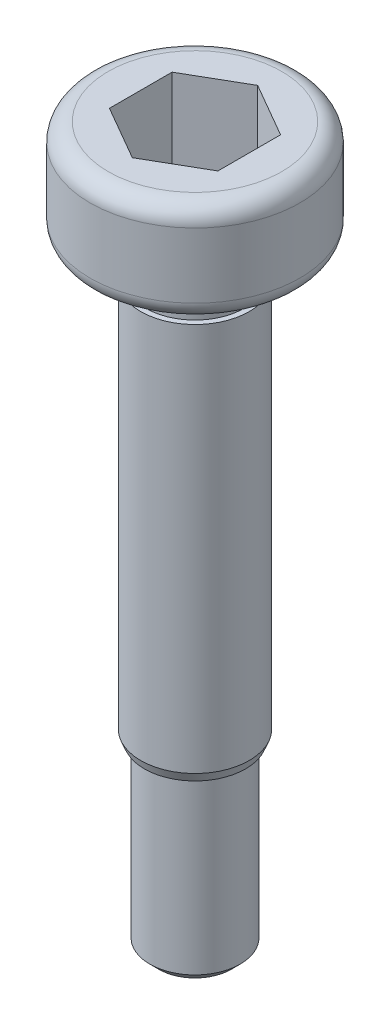
ISO-10303-21;
HEADER;
FILE_DESCRIPTION(('STEP AP214'),'2;1');
FILE_NAME('part.step','',(''),(''),'','','');
FILE_SCHEMA(('AUTOMOTIVE_DESIGN { 1 0 10303 214 1 1 1 1 }'));
ENDSEC;
DATA;
#1=APPLICATION_CONTEXT('core data for automotive mechanical design processes');
#2=APPLICATION_PROTOCOL_DEFINITION('international standard','automotive_design',2000,#1);
#3=PRODUCT_CONTEXT('',#1,'mechanical');
#4=PRODUCT('Part','Part','',(#3));
#5=PRODUCT_RELATED_PRODUCT_CATEGORY('part','',(#4));
#6=PRODUCT_DEFINITION_FORMATION('','',#4);
#7=PRODUCT_DEFINITION_CONTEXT('part definition',#1,'design');
#8=PRODUCT_DEFINITION('design','',#6,#7);
#9=PRODUCT_DEFINITION_SHAPE('','',#8);
#10=(LENGTH_UNIT() NAMED_UNIT(*) SI_UNIT(.MILLI.,.METRE.));
#11=(NAMED_UNIT(*) PLANE_ANGLE_UNIT() SI_UNIT($,.RADIAN.));
#12=(NAMED_UNIT(*) SI_UNIT($,.STERADIAN.) SOLID_ANGLE_UNIT());
#13=UNCERTAINTY_MEASURE_WITH_UNIT(LENGTH_MEASURE(1.E-05),#10,'distance_accuracy_value','');
#14=(GEOMETRIC_REPRESENTATION_CONTEXT(3) GLOBAL_UNCERTAINTY_ASSIGNED_CONTEXT((#13)) GLOBAL_UNIT_ASSIGNED_CONTEXT((#10,
#11,#12)) REPRESENTATION_CONTEXT('',''));
#15=CARTESIAN_POINT('',(0.,0.,0.));
#16=DIRECTION('',(0.,0.,1.));
#17=DIRECTION('',(1.,0.,0.));
#18=AXIS2_PLACEMENT_3D('',#15,#16,#17);
#19=CARTESIAN_POINT('',(0.,-14.55,0.));
#20=DIRECTION('',(0.,1.,0.));
#21=DIRECTION('',(0.,0.,1.));
#22=AXIS2_PLACEMENT_3D('',#19,#20,#21);
#23=CONICAL_SURFACE('',#22,1.5,0.380506377112365);
#24=CARTESIAN_POINT('',(0.,-14.8,0.));
#25=DIRECTION('',(0.,1.,0.));
#26=DIRECTION('',(0.,0.,1.));
#27=AXIS2_PLACEMENT_3D('',#24,#25,#26);
#28=CIRCLE('',#27,1.4);
#29=CARTESIAN_POINT('',(0.,-14.8,1.4));
#30=VERTEX_POINT('',#29);
#31=EDGE_CURVE('E181',#30,#30,#28,.T.);
#32=ORIENTED_EDGE('',*,*,#31,.T.);
#33=EDGE_LOOP('',(#32));
#34=FACE_BOUND('',#33,.T.);
#35=CARTESIAN_POINT('',(0.,-14.55,0.));
#36=DIRECTION('',(0.,1.,0.));
#37=DIRECTION('',(0.,0.,1.));
#38=AXIS2_PLACEMENT_3D('',#35,#36,#37);
#39=CIRCLE('',#38,1.5);
#40=CARTESIAN_POINT('',(0.,-14.55,1.5));
#41=VERTEX_POINT('',#40);
#42=EDGE_CURVE('E175',#41,#41,#39,.T.);
#43=ORIENTED_EDGE('',*,*,#42,.F.);
#44=EDGE_LOOP('',(#43));
#45=FACE_BOUND('',#44,.T.);
#46=ADVANCED_FACE('F43',(#34,#45),#23,.T.);
#47=CARTESIAN_POINT('',(1.4,-14.8,0.));
#48=DIRECTION('',(0.,-1.,0.));
#49=DIRECTION('',(0.,0.,-1.));
#50=AXIS2_PLACEMENT_3D('',#47,#48,#49);
#51=PLANE('',#50);
#52=CARTESIAN_POINT('',(0.,-14.8,0.));
#53=DIRECTION('',(0.,-1.,0.));
#54=DIRECTION('',(1.,0.,0.));
#55=AXIS2_PLACEMENT_3D('',#52,#53,#54);
#56=CIRCLE('',#55,1.25);
#57=CARTESIAN_POINT('',(1.25,-14.8,0.));
#58=VERTEX_POINT('',#57);
#59=EDGE_CURVE('E176',#58,#58,#56,.T.);
#60=ORIENTED_EDGE('',*,*,#59,.F.);
#61=EDGE_LOOP('',(#60));
#62=FACE_BOUND('',#61,.T.);
#63=ORIENTED_EDGE('',*,*,#31,.F.);
#64=EDGE_LOOP('',(#63));
#65=FACE_BOUND('',#64,.T.);
#66=ADVANCED_FACE('F221',(#62,#65),#51,.T.);
#67=CARTESIAN_POINT('',(0.,0.,0.));
#68=DIRECTION('',(0.,1.,0.));
#69=DIRECTION('',(0.,0.,1.));
#70=AXIS2_PLACEMENT_3D('',#67,#68,#69);
#71=PLANE('',#70);
#72=CARTESIAN_POINT('',(0.,0.,0.));
#73=DIRECTION('',(0.,1.,0.));
#74=DIRECTION('',(0.,0.,1.));
#75=AXIS2_PLACEMENT_3D('',#72,#73,#74);
#76=CIRCLE('',#75,2.4);
#77=CARTESIAN_POINT('',(0.,0.,2.4));
#78=VERTEX_POINT('',#77);
#79=EDGE_CURVE('E180',#78,#78,#76,.T.);
#80=ORIENTED_EDGE('',*,*,#79,.T.);
#81=EDGE_LOOP('',(#80));
#82=FACE_BOUND('',#81,.T.);
#83=DIRECTION('',(0.866025403784438,0.,-0.5));
#84=VECTOR('',#83,1.);
#85=CARTESIAN_POINT('',(0.,0.,1.73205080756888));
#86=LINE('',#85,#84);
#87=CARTESIAN_POINT('',(0.,0.,1.73205080756888));
#88=VERTEX_POINT('',#87);
#89=CARTESIAN_POINT('',(1.5,0.,0.86602540378444));
#90=VERTEX_POINT('',#89);
#91=EDGE_CURVE('E59',#88,#90,#86,.T.);
#92=ORIENTED_EDGE('',*,*,#91,.F.);
#93=DIRECTION('',(0.866025403784438,0.,0.500000000000001));
#94=VECTOR('',#93,1.);
#95=CARTESIAN_POINT('',(-1.5,0.,0.86602540378444));
#96=LINE('',#95,#94);
#97=CARTESIAN_POINT('',(-1.5,0.,0.86602540378444));
#98=VERTEX_POINT('',#97);
#99=EDGE_CURVE('E152',#98,#88,#96,.T.);
#100=ORIENTED_EDGE('',*,*,#99,.F.);
#101=DIRECTION('',(0.,0.,1.));
#102=VECTOR('',#101,1.);
#103=CARTESIAN_POINT('',(-1.5,0.,-0.866025403784439));
#104=LINE('',#103,#102);
#105=CARTESIAN_POINT('',(-1.5,0.,-0.866025403784439));
#106=VERTEX_POINT('',#105);
#107=EDGE_CURVE('E149',#106,#98,#104,.T.);
#108=ORIENTED_EDGE('',*,*,#107,.F.);
#109=DIRECTION('',(-0.866025403784438,0.,0.500000000000001));
#110=VECTOR('',#109,1.);
#111=CARTESIAN_POINT('',(0.,0.,-1.73205080756888));
#112=LINE('',#111,#110);
#113=CARTESIAN_POINT('',(0.,0.,-1.73205080756888));
#114=VERTEX_POINT('',#113);
#115=EDGE_CURVE('E107',#114,#106,#112,.T.);
#116=ORIENTED_EDGE('',*,*,#115,.F.);
#117=DIRECTION('',(-0.866025403784438,0.,-0.500000000000001));
#118=VECTOR('',#117,1.);
#119=CARTESIAN_POINT('',(1.5,0.,-0.866025403784439));
#120=LINE('',#119,#118);
#121=CARTESIAN_POINT('',(1.5,0.,-0.866025403784439));
#122=VERTEX_POINT('',#121);
#123=EDGE_CURVE('E143',#122,#114,#120,.T.);
#124=ORIENTED_EDGE('',*,*,#123,.F.);
#125=DIRECTION('',(0.,0.,-1.));
#126=VECTOR('',#125,1.);
#127=CARTESIAN_POINT('',(1.5,0.,0.86602540378444));
#128=LINE('',#127,#126);
#129=EDGE_CURVE('E139',#90,#122,#128,.T.);
#130=ORIENTED_EDGE('',*,*,#129,.F.);
#131=EDGE_LOOP('',(#92,#100,#108,#116,#124,#130));
#132=FACE_BOUND('',#131,.T.);
#133=ADVANCED_FACE('F218',(#82,#132),#71,.T.);
#134=CARTESIAN_POINT('',(0.,-14.8,0.));
#135=DIRECTION('',(0.,1.,0.));
#136=DIRECTION('',(0.,0.,1.));
#137=AXIS2_PLACEMENT_3D('',#134,#135,#136);
#138=CYLINDRICAL_SURFACE('',#137,2.9);
#139=CARTESIAN_POINT('',(0.,-0.5,0.));
#140=DIRECTION('',(0.,1.,0.));
#141=DIRECTION('',(0.,0.,1.));
#142=AXIS2_PLACEMENT_3D('',#139,#140,#141);
#143=CIRCLE('',#142,2.9);
#144=CARTESIAN_POINT('',(0.,-0.5,2.9));
#145=VERTEX_POINT('',#144);
#146=EDGE_CURVE('E52',#145,#145,#143,.F.);
#147=ORIENTED_EDGE('',*,*,#146,.T.);
#148=EDGE_LOOP('',(#147));
#149=FACE_BOUND('',#148,.T.);
#150=CARTESIAN_POINT('',(0.,-2.3,0.));
#151=DIRECTION('',(0.,-1.,0.));
#152=DIRECTION('',(0.,0.,-1.));
#153=AXIS2_PLACEMENT_3D('',#150,#151,#152);
#154=CIRCLE('',#153,2.9);
#155=CARTESIAN_POINT('',(0.,-2.3,-2.9));
#156=VERTEX_POINT('',#155);
#157=EDGE_CURVE('E203',#156,#156,#154,.F.);
#158=ORIENTED_EDGE('',*,*,#157,.T.);
#159=EDGE_LOOP('',(#158));
#160=FACE_BOUND('',#159,.T.);
#161=ADVANCED_FACE('F210',(#149,#160),#138,.T.);
#162=CARTESIAN_POINT('',(2.9,-2.8,0.));
#163=DIRECTION('',(0.,-1.,0.));
#164=DIRECTION('',(0.,0.,-1.));
#165=AXIS2_PLACEMENT_3D('',#162,#163,#164);
#166=PLANE('',#165);
#167=CARTESIAN_POINT('',(0.,-2.8,0.));
#168=DIRECTION('',(0.,-1.,0.));
#169=DIRECTION('',(0.,0.,-1.));
#170=AXIS2_PLACEMENT_3D('',#167,#168,#169);
#171=CIRCLE('',#170,2.4);
#172=CARTESIAN_POINT('',(0.,-2.8,-2.4));
#173=VERTEX_POINT('',#172);
#174=EDGE_CURVE('E11',#173,#173,#171,.T.);
#175=ORIENTED_EDGE('',*,*,#174,.T.);
#176=EDGE_LOOP('',(#175));
#177=FACE_BOUND('',#176,.T.);
#178=CARTESIAN_POINT('',(0.,-2.8,0.));
#179=DIRECTION('',(0.,1.,0.));
#180=DIRECTION('',(0.,0.,1.));
#181=AXIS2_PLACEMENT_3D('',#178,#179,#180);
#182=CIRCLE('',#181,1.35);
#183=CARTESIAN_POINT('',(0.,-2.8,1.35));
#184=VERTEX_POINT('',#183);
#185=EDGE_CURVE('E193',#184,#184,#182,.T.);
#186=ORIENTED_EDGE('',*,*,#185,.T.);
#187=EDGE_LOOP('',(#186));
#188=FACE_BOUND('',#187,.T.);
#189=ADVANCED_FACE('F257',(#177,#188),#166,.T.);
#190=CARTESIAN_POINT('',(0.,-14.8,0.));
#191=DIRECTION('',(0.,1.,0.));
#192=DIRECTION('',(0.,0.,1.));
#193=AXIS2_PLACEMENT_3D('',#190,#191,#192);
#194=CYLINDRICAL_SURFACE('',#193,1.35);
#195=CARTESIAN_POINT('',(0.,-3.8,0.));
#196=DIRECTION('',(0.,1.,0.));
#197=DIRECTION('',(0.,0.,1.));
#198=AXIS2_PLACEMENT_3D('',#195,#196,#197);
#199=CIRCLE('',#198,1.35);
#200=CARTESIAN_POINT('',(0.,-3.8,1.35));
#201=VERTEX_POINT('',#200);
#202=EDGE_CURVE('E189',#201,#201,#199,.T.);
#203=ORIENTED_EDGE('',*,*,#202,.T.);
#204=EDGE_LOOP('',(#203));
#205=FACE_BOUND('',#204,.T.);
#206=ORIENTED_EDGE('',*,*,#185,.F.);
#207=EDGE_LOOP('',(#206));
#208=FACE_BOUND('',#207,.T.);
#209=ADVANCED_FACE('F260',(#205,#208),#194,.T.);
#210=CARTESIAN_POINT('',(1.35,-3.8,0.));
#211=DIRECTION('',(0.,1.,0.));
#212=DIRECTION('',(0.,0.,1.));
#213=AXIS2_PLACEMENT_3D('',#210,#211,#212);
#214=PLANE('',#213);
#215=CARTESIAN_POINT('',(0.,-3.8,0.));
#216=DIRECTION('',(0.,1.,0.));
#217=DIRECTION('',(0.,0.,1.));
#218=AXIS2_PLACEMENT_3D('',#215,#216,#217);
#219=CIRCLE('',#218,1.5);
#220=CARTESIAN_POINT('',(0.,-3.8,1.5));
#221=VERTEX_POINT('',#220);
#222=EDGE_CURVE('E185',#221,#221,#219,.T.);
#223=ORIENTED_EDGE('',*,*,#222,.T.);
#224=EDGE_LOOP('',(#223));
#225=FACE_BOUND('',#224,.T.);
#226=ORIENTED_EDGE('',*,*,#202,.F.);
#227=EDGE_LOOP('',(#226));
#228=FACE_BOUND('',#227,.T.);
#229=ADVANCED_FACE('F264',(#225,#228),#214,.T.);
#230=CARTESIAN_POINT('',(0.,-14.8,0.));
#231=DIRECTION('',(0.,1.,0.));
#232=DIRECTION('',(0.,0.,1.));
#233=AXIS2_PLACEMENT_3D('',#230,#231,#232);
#234=CYLINDRICAL_SURFACE('',#233,1.5);
#235=ORIENTED_EDGE('',*,*,#42,.T.);
#236=EDGE_LOOP('',(#235));
#237=FACE_BOUND('',#236,.T.);
#238=ORIENTED_EDGE('',*,*,#222,.F.);
#239=EDGE_LOOP('',(#238));
#240=FACE_BOUND('',#239,.T.);
#241=ADVANCED_FACE('F268',(#237,#240),#234,.T.);
#242=CARTESIAN_POINT('',(0.,-19.55,0.));
#243=DIRECTION('',(0.,1.,0.));
#244=DIRECTION('',(-1.,0.,0.));
#245=AXIS2_PLACEMENT_3D('',#242,#243,#244);
#246=CYLINDRICAL_SURFACE('',#245,1.25);
#247=CARTESIAN_POINT('',(0.,-19.55,0.));
#248=DIRECTION('',(0.,-1.,0.));
#249=DIRECTION('',(1.,0.,0.));
#250=AXIS2_PLACEMENT_3D('',#247,#248,#249);
#251=CIRCLE('',#250,1.25);
#252=CARTESIAN_POINT('',(1.25,-19.55,0.));
#253=VERTEX_POINT('',#252);
#254=EDGE_CURVE('E171',#253,#253,#251,.T.);
#255=ORIENTED_EDGE('',*,*,#254,.F.);
#256=EDGE_LOOP('',(#255));
#257=FACE_BOUND('',#256,.T.);
#258=ORIENTED_EDGE('',*,*,#59,.T.);
#259=EDGE_LOOP('',(#258));
#260=FACE_BOUND('',#259,.T.);
#261=ADVANCED_FACE('F272',(#257,#260),#246,.T.);
#262=CARTESIAN_POINT('',(0.,-19.55,0.));
#263=DIRECTION('',(0.,1.,0.));
#264=DIRECTION('',(1.,0.,0.));
#265=AXIS2_PLACEMENT_3D('',#262,#263,#264);
#266=CONICAL_SURFACE('',#265,1.25,0.785398163397437);
#267=CARTESIAN_POINT('',(0.,-19.8,0.));
#268=DIRECTION('',(0.,-1.,0.));
#269=DIRECTION('',(1.,0.,0.));
#270=AXIS2_PLACEMENT_3D('',#267,#268,#269);
#271=CIRCLE('',#270,1.00000000000001);
#272=CARTESIAN_POINT('',(1.00000000000001,-19.8,0.));
#273=VERTEX_POINT('',#272);
#274=EDGE_CURVE('E158',#273,#273,#271,.T.);
#275=ORIENTED_EDGE('',*,*,#274,.F.);
#276=EDGE_LOOP('',(#275));
#277=FACE_BOUND('',#276,.T.);
#278=ORIENTED_EDGE('',*,*,#254,.T.);
#279=EDGE_LOOP('',(#278));
#280=FACE_BOUND('',#279,.T.);
#281=ADVANCED_FACE('F241',(#277,#280),#266,.T.);
#282=CARTESIAN_POINT('',(0.,-19.8,0.));
#283=DIRECTION('',(0.,-1.,0.));
#284=DIRECTION('',(1.,0.,0.));
#285=AXIS2_PLACEMENT_3D('',#282,#283,#284);
#286=PLANE('',#285);
#287=ORIENTED_EDGE('',*,*,#274,.T.);
#288=EDGE_LOOP('',(#287));
#289=FACE_BOUND('',#288,.T.);
#290=ADVANCED_FACE('F234',(#289),#286,.T.);
#291=CARTESIAN_POINT('',(0.,-2.4,1.73205080756888));
#292=DIRECTION('',(0.5,0.,0.866025403784438));
#293=DIRECTION('',(0.866025403784439,0.,-0.5));
#294=AXIS2_PLACEMENT_3D('',#291,#292,#293);
#295=PLANE('',#294);
#296=ORIENTED_EDGE('',*,*,#91,.T.);
#297=DIRECTION('',(0.,1.,0.));
#298=VECTOR('',#297,1.);
#299=CARTESIAN_POINT('',(1.5,-2.4,0.86602540378444));
#300=LINE('',#299,#298);
#301=CARTESIAN_POINT('',(1.5,-2.4,0.86602540378444));
#302=VERTEX_POINT('',#301);
#303=EDGE_CURVE('E89',#302,#90,#300,.T.);
#304=ORIENTED_EDGE('',*,*,#303,.F.);
#305=DIRECTION('',(0.866025403784438,0.,-0.5));
#306=VECTOR('',#305,1.);
#307=CARTESIAN_POINT('',(0.,-2.4,1.73205080756888));
#308=LINE('',#307,#306);
#309=CARTESIAN_POINT('',(0.,-2.4,1.73205080756888));
#310=VERTEX_POINT('',#309);
#311=EDGE_CURVE('E155',#310,#302,#308,.T.);
#312=ORIENTED_EDGE('',*,*,#311,.F.);
#313=DIRECTION('',(0.,1.,0.));
#314=VECTOR('',#313,1.);
#315=CARTESIAN_POINT('',(0.,-2.4,1.73205080756888));
#316=LINE('',#315,#314);
#317=EDGE_CURVE('E67',#310,#88,#316,.T.);
#318=ORIENTED_EDGE('',*,*,#317,.T.);
#319=EDGE_LOOP('',(#296,#304,#312,#318));
#320=FACE_BOUND('',#319,.T.);
#321=ADVANCED_FACE('F231',(#320),#295,.F.);
#322=CARTESIAN_POINT('',(-1.5,-2.4,0.86602540378444));
#323=DIRECTION('',(-0.500000000000001,0.,0.866025403784438));
#324=DIRECTION('',(0.866025403784438,0.,0.500000000000001));
#325=AXIS2_PLACEMENT_3D('',#322,#323,#324);
#326=PLANE('',#325);
#327=ORIENTED_EDGE('',*,*,#99,.T.);
#328=ORIENTED_EDGE('',*,*,#317,.F.);
#329=DIRECTION('',(0.866025403784438,0.,0.500000000000001));
#330=VECTOR('',#329,1.);
#331=CARTESIAN_POINT('',(-1.5,-2.4,0.86602540378444));
#332=LINE('',#331,#330);
#333=CARTESIAN_POINT('',(-1.5,-2.4,0.86602540378444));
#334=VERTEX_POINT('',#333);
#335=EDGE_CURVE('E121',#334,#310,#332,.T.);
#336=ORIENTED_EDGE('',*,*,#335,.F.);
#337=DIRECTION('',(0.,1.,0.));
#338=VECTOR('',#337,1.);
#339=CARTESIAN_POINT('',(-1.5,-2.4,0.86602540378444));
#340=LINE('',#339,#338);
#341=EDGE_CURVE('E112',#334,#98,#340,.T.);
#342=ORIENTED_EDGE('',*,*,#341,.T.);
#343=EDGE_LOOP('',(#327,#328,#336,#342));
#344=FACE_BOUND('',#343,.T.);
#345=ADVANCED_FACE('F233',(#344),#326,.F.);
#346=CARTESIAN_POINT('',(-1.5,-2.4,-0.866025403784439));
#347=DIRECTION('',(-1.,0.,0.));
#348=DIRECTION('',(0.,-1.,0.));
#349=AXIS2_PLACEMENT_3D('',#346,#347,#348);
#350=PLANE('',#349);
#351=ORIENTED_EDGE('',*,*,#107,.T.);
#352=ORIENTED_EDGE('',*,*,#341,.F.);
#353=DIRECTION('',(0.,0.,1.));
#354=VECTOR('',#353,1.);
#355=CARTESIAN_POINT('',(-1.5,-2.4,-0.866025403784439));
#356=LINE('',#355,#354);
#357=CARTESIAN_POINT('',(-1.5,-2.4,-0.866025403784439));
#358=VERTEX_POINT('',#357);
#359=EDGE_CURVE('E116',#358,#334,#356,.T.);
#360=ORIENTED_EDGE('',*,*,#359,.F.);
#361=DIRECTION('',(0.,1.,0.));
#362=VECTOR('',#361,1.);
#363=CARTESIAN_POINT('',(-1.5,-2.4,-0.866025403784439));
#364=LINE('',#363,#362);
#365=EDGE_CURVE('E100',#358,#106,#364,.T.);
#366=ORIENTED_EDGE('',*,*,#365,.T.);
#367=EDGE_LOOP('',(#351,#352,#360,#366));
#368=FACE_BOUND('',#367,.T.);
#369=ADVANCED_FACE('F117',(#368),#350,.F.);
#370=CARTESIAN_POINT('',(0.,-2.4,-1.73205080756888));
#371=DIRECTION('',(-0.500000000000001,0.,-0.866025403784438));
#372=DIRECTION('',(-0.866025403784438,0.,0.500000000000001));
#373=AXIS2_PLACEMENT_3D('',#370,#371,#372);
#374=PLANE('',#373);
#375=ORIENTED_EDGE('',*,*,#115,.T.);
#376=ORIENTED_EDGE('',*,*,#365,.F.);
#377=DIRECTION('',(-0.866025403784438,0.,0.500000000000001));
#378=VECTOR('',#377,1.);
#379=CARTESIAN_POINT('',(0.,-2.4,-1.73205080756888));
#380=LINE('',#379,#378);
#381=CARTESIAN_POINT('',(0.,-2.4,-1.73205080756888));
#382=VERTEX_POINT('',#381);
#383=EDGE_CURVE('E104',#382,#358,#380,.T.);
#384=ORIENTED_EDGE('',*,*,#383,.F.);
#385=DIRECTION('',(0.,1.,0.));
#386=VECTOR('',#385,1.);
#387=CARTESIAN_POINT('',(0.,-2.4,-1.73205080756888));
#388=LINE('',#387,#386);
#389=EDGE_CURVE('E113',#382,#114,#388,.T.);
#390=ORIENTED_EDGE('',*,*,#389,.T.);
#391=EDGE_LOOP('',(#375,#376,#384,#390));
#392=FACE_BOUND('',#391,.T.);
#393=ADVANCED_FACE('F102',(#392),#374,.F.);
#394=CARTESIAN_POINT('',(1.5,-2.4,-0.866025403784439));
#395=DIRECTION('',(0.500000000000001,0.,-0.866025403784438));
#396=DIRECTION('',(-0.866025403784438,0.,-0.500000000000001));
#397=AXIS2_PLACEMENT_3D('',#394,#395,#396);
#398=PLANE('',#397);
#399=ORIENTED_EDGE('',*,*,#123,.T.);
#400=ORIENTED_EDGE('',*,*,#389,.F.);
#401=DIRECTION('',(-0.866025403784438,0.,-0.500000000000001));
#402=VECTOR('',#401,1.);
#403=CARTESIAN_POINT('',(1.5,-2.4,-0.866025403784439));
#404=LINE('',#403,#402);
#405=CARTESIAN_POINT('',(1.5,-2.4,-0.866025403784439));
#406=VERTEX_POINT('',#405);
#407=EDGE_CURVE('E127',#406,#382,#404,.T.);
#408=ORIENTED_EDGE('',*,*,#407,.F.);
#409=DIRECTION('',(0.,1.,0.));
#410=VECTOR('',#409,1.);
#411=CARTESIAN_POINT('',(1.5,-2.4,-0.866025403784439));
#412=LINE('',#411,#410);
#413=EDGE_CURVE('E163',#406,#122,#412,.T.);
#414=ORIENTED_EDGE('',*,*,#413,.T.);
#415=EDGE_LOOP('',(#399,#400,#408,#414));
#416=FACE_BOUND('',#415,.T.);
#417=ADVANCED_FACE('F322',(#416),#398,.F.);
#418=CARTESIAN_POINT('',(1.5,-2.4,0.86602540378444));
#419=DIRECTION('',(1.,0.,0.));
#420=DIRECTION('',(0.,1.,0.));
#421=AXIS2_PLACEMENT_3D('',#418,#419,#420);
#422=PLANE('',#421);
#423=ORIENTED_EDGE('',*,*,#129,.T.);
#424=ORIENTED_EDGE('',*,*,#413,.F.);
#425=DIRECTION('',(0.,0.,-1.));
#426=VECTOR('',#425,1.);
#427=CARTESIAN_POINT('',(1.5,-2.4,0.86602540378444));
#428=LINE('',#427,#426);
#429=EDGE_CURVE('E131',#302,#406,#428,.T.);
#430=ORIENTED_EDGE('',*,*,#429,.F.);
#431=ORIENTED_EDGE('',*,*,#303,.T.);
#432=EDGE_LOOP('',(#423,#424,#430,#431));
#433=FACE_BOUND('',#432,.T.);
#434=ADVANCED_FACE('F227',(#433),#422,.F.);
#435=CARTESIAN_POINT('',(0.,-2.4,0.));
#436=DIRECTION('',(0.,1.,0.));
#437=DIRECTION('',(-1.,0.,0.));
#438=AXIS2_PLACEMENT_3D('',#435,#436,#437);
#439=PLANE('',#438);
#440=ORIENTED_EDGE('',*,*,#311,.T.);
#441=ORIENTED_EDGE('',*,*,#429,.T.);
#442=ORIENTED_EDGE('',*,*,#407,.T.);
#443=ORIENTED_EDGE('',*,*,#383,.T.);
#444=ORIENTED_EDGE('',*,*,#359,.T.);
#445=ORIENTED_EDGE('',*,*,#335,.T.);
#446=EDGE_LOOP('',(#440,#441,#442,#443,#444,#445));
#447=FACE_BOUND('',#446,.T.);
#448=ADVANCED_FACE('F124',(#447),#439,.T.);
#449=CARTESIAN_POINT('',(0.,-0.5,0.));
#450=DIRECTION('',(0.,1.,0.));
#451=DIRECTION('',(0.,0.,1.));
#452=AXIS2_PLACEMENT_3D('',#449,#450,#451);
#453=TOROIDAL_SURFACE('',#452,2.4,0.5);
#454=ORIENTED_EDGE('',*,*,#146,.F.);
#455=EDGE_LOOP('',(#454));
#456=FACE_BOUND('',#455,.T.);
#457=ORIENTED_EDGE('',*,*,#79,.F.);
#458=EDGE_LOOP('',(#457));
#459=FACE_BOUND('',#458,.T.);
#460=ADVANCED_FACE('F213',(#456,#459),#453,.T.);
#461=CARTESIAN_POINT('',(0.,-2.3,0.));
#462=DIRECTION('',(0.,-1.,0.));
#463=DIRECTION('',(0.,0.,-1.));
#464=AXIS2_PLACEMENT_3D('',#461,#462,#463);
#465=TOROIDAL_SURFACE('',#464,2.4,0.5);
#466=ORIENTED_EDGE('',*,*,#174,.F.);
#467=EDGE_LOOP('',(#466));
#468=FACE_BOUND('',#467,.T.);
#469=ORIENTED_EDGE('',*,*,#157,.F.);
#470=EDGE_LOOP('',(#469));
#471=FACE_BOUND('',#470,.T.);
#472=ADVANCED_FACE('F45',(#468,#471),#465,.T.);
#473=CLOSED_SHELL('',(#46,#66,#133,#161,#189,#209,#229,#241,#261,#281,#290,#321,#345,#369,#393,
#417,#434,#448,#460,#472));
#474=MANIFOLD_SOLID_BREP('B2',#473);
#475=ADVANCED_BREP_SHAPE_REPRESENTATION('',(#18,#474),#14);
#476=SHAPE_DEFINITION_REPRESENTATION(#9,#475);
ENDSEC;
END-ISO-10303-21;
